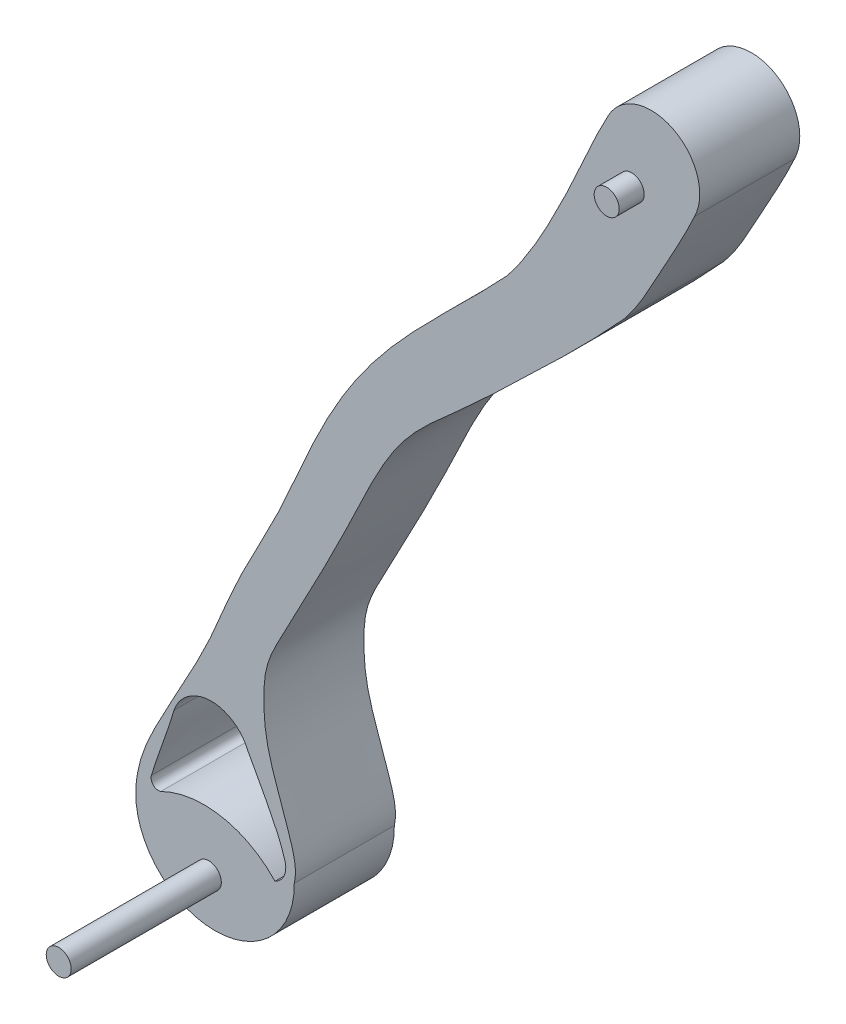
ISO-10303-21;
HEADER;
FILE_DESCRIPTION(('STEP AP214'),'2;1');
FILE_NAME('part.step','',(''),(''),'','','');
FILE_SCHEMA(('AUTOMOTIVE_DESIGN { 1 0 10303 214 1 1 1 1 }'));
ENDSEC;
DATA;
#1=APPLICATION_CONTEXT('core data for automotive mechanical design processes');
#2=APPLICATION_PROTOCOL_DEFINITION('international standard','automotive_design',2000,#1);
#3=PRODUCT_CONTEXT('',#1,'mechanical');
#4=PRODUCT('Part','Part','',(#3));
#5=PRODUCT_RELATED_PRODUCT_CATEGORY('part','',(#4));
#6=PRODUCT_DEFINITION_FORMATION('','',#4);
#7=PRODUCT_DEFINITION_CONTEXT('part definition',#1,'design');
#8=PRODUCT_DEFINITION('design','',#6,#7);
#9=PRODUCT_DEFINITION_SHAPE('','',#8);
#10=(LENGTH_UNIT() NAMED_UNIT(*) SI_UNIT(.MILLI.,.METRE.));
#11=(NAMED_UNIT(*) PLANE_ANGLE_UNIT() SI_UNIT($,.RADIAN.));
#12=(NAMED_UNIT(*) SI_UNIT($,.STERADIAN.) SOLID_ANGLE_UNIT());
#13=UNCERTAINTY_MEASURE_WITH_UNIT(LENGTH_MEASURE(1.E-05),#10,'distance_accuracy_value','');
#14=(GEOMETRIC_REPRESENTATION_CONTEXT(3) GLOBAL_UNCERTAINTY_ASSIGNED_CONTEXT((#13)) GLOBAL_UNIT_ASSIGNED_CONTEXT((#10,
#11,#12)) REPRESENTATION_CONTEXT('',''));
#15=CARTESIAN_POINT('',(0.,0.,0.));
#16=DIRECTION('',(0.,0.,1.));
#17=DIRECTION('',(1.,0.,0.));
#18=AXIS2_PLACEMENT_3D('',#15,#16,#17);
#19=CARTESIAN_POINT('',(60.3871939047688,187.542653548345,40.));
#20=CARTESIAN_POINT('',(55.8290363319542,179.301734235559,40.));
#21=CARTESIAN_POINT('',(48.5414420568133,162.180154607275,40.));
#22=CARTESIAN_POINT('',(36.0717803356837,136.393112865511,40.));
#23=CARTESIAN_POINT('',(26.2480929802239,119.800552758437,40.));
#24=CARTESIAN_POINT('',(19.9390279093565,111.952234191218,40.));
#25=B_SPLINE_CURVE_WITH_KNOTS('',3,(#19,#20,#21,#22,#23,#24),.UNSPECIFIED.,.F.,.F.,(4,1,1,4),
(0.,0.328457342126974,0.649354288135533,1.),.UNSPECIFIED.);
#26=DIRECTION('',(0.,0.,-1.));
#27=VECTOR('',#26,1.);
#28=SURFACE_OF_LINEAR_EXTRUSION('',#25,#27);
#29=CARTESIAN_POINT('',(60.3871939047688,187.542653548345,0.));
#30=CARTESIAN_POINT('',(55.8290363319542,179.301734235559,0.));
#31=CARTESIAN_POINT('',(48.5414420568133,162.180154607275,0.));
#32=CARTESIAN_POINT('',(36.0717803356837,136.393112865511,0.));
#33=CARTESIAN_POINT('',(26.2480929802239,119.800552758437,0.));
#34=CARTESIAN_POINT('',(19.9390279093565,111.952234191218,0.));
#35=B_SPLINE_CURVE_WITH_KNOTS('',3,(#29,#30,#31,#32,#33,#34),.UNSPECIFIED.,.F.,.F.,(4,1,1,4),
(0.,0.328457342126974,0.649354288135533,1.),.UNSPECIFIED.);
#36=CARTESIAN_POINT('',(60.3871939047688,187.542653548345,0.));
#37=VERTEX_POINT('',#36);
#38=CARTESIAN_POINT('',(19.9390279093565,111.952234191218,0.));
#39=VERTEX_POINT('',#38);
#40=EDGE_CURVE('E212',#37,#39,#35,.T.);
#41=ORIENTED_EDGE('',*,*,#40,.T.);
#42=DIRECTION('',(0.,0.,-1.));
#43=VECTOR('',#42,1.);
#44=CARTESIAN_POINT('',(19.9390279093565,111.952234191218,40.));
#45=LINE('',#44,#43);
#46=CARTESIAN_POINT('',(19.9390279093565,111.952234191218,40.));
#47=VERTEX_POINT('',#46);
#48=EDGE_CURVE('E261',#47,#39,#45,.T.);
#49=ORIENTED_EDGE('',*,*,#48,.F.);
#50=CARTESIAN_POINT('',(60.3871939047688,187.542653548345,40.));
#51=VERTEX_POINT('',#50);
#52=EDGE_CURVE('E246',#51,#47,#25,.T.);
#53=ORIENTED_EDGE('',*,*,#52,.F.);
#54=DIRECTION('',(0.,0.,-1.));
#55=VECTOR('',#54,1.);
#56=CARTESIAN_POINT('',(60.3871939047688,187.542653548345,40.));
#57=LINE('',#56,#55);
#58=EDGE_CURVE('E211',#51,#37,#57,.T.);
#59=ORIENTED_EDGE('',*,*,#58,.T.);
#60=EDGE_LOOP('',(#41,#49,#53,#59));
#61=FACE_BOUND('',#60,.T.);
#62=ADVANCED_FACE('F40',(#61),#28,.F.);
#63=CARTESIAN_POINT('',(19.9390279093565,111.952234191218,40.));
#64=CARTESIAN_POINT('',(3.65232556956879,94.3290387479032,40.));
#65=CARTESIAN_POINT('',(-20.2496056722117,73.6219313673964,40.));
#66=CARTESIAN_POINT('',(-45.6524290616376,39.0411420736974,40.));
#67=CARTESIAN_POINT('',(-58.8426468973011,13.6097033064801,40.));
#68=CARTESIAN_POINT('',(-71.7894873232042,-18.0719905640691,40.));
#69=CARTESIAN_POINT('',(-87.738861669202,-45.500334261071,40.));
#70=CARTESIAN_POINT('',(-100.863433522927,-79.9213549862569,40.));
#71=CARTESIAN_POINT('',(-115.452059141126,-103.788445803052,40.));
#72=CARTESIAN_POINT('',(-126.143907941595,-125.769991296804,40.));
#73=CARTESIAN_POINT('',(-128.340182149036,-135.353702394417,40.));
#74=CARTESIAN_POINT('',(-128.435303346591,-140.896902452704,40.));
#75=B_SPLINE_CURVE_WITH_KNOTS('',3,(#63,#64,#65,#66,#67,#68,#69,#70,#71,#72,#73,#74),
.UNSPECIFIED.,.F.,.F.,(4,1,1,1,1,1,1,1,1,4),(0.,0.227860935563209,0.297082932040431,
0.405625713010245,0.49841550509689,0.621398377971298,0.705377541129316,0.846798383266303,
0.885360920028116,0.937345031613258),.UNSPECIFIED.);
#76=DIRECTION('',(0.,0.,-1.));
#77=VECTOR('',#76,1.);
#78=SURFACE_OF_LINEAR_EXTRUSION('',#75,#77);
#79=CARTESIAN_POINT('',(19.9390279093565,111.952234191218,0.));
#80=CARTESIAN_POINT('',(3.65232556956879,94.3290387479032,0.));
#81=CARTESIAN_POINT('',(-20.2496056722117,73.6219313673964,0.));
#82=CARTESIAN_POINT('',(-45.6524290616376,39.0411420736974,0.));
#83=CARTESIAN_POINT('',(-58.8426468973011,13.6097033064801,0.));
#84=CARTESIAN_POINT('',(-71.7894873232042,-18.0719905640691,0.));
#85=CARTESIAN_POINT('',(-87.738861669202,-45.500334261071,0.));
#86=CARTESIAN_POINT('',(-100.863433522927,-79.9213549862569,0.));
#87=CARTESIAN_POINT('',(-115.452059141126,-103.788445803052,0.));
#88=CARTESIAN_POINT('',(-126.143907941595,-125.769991296804,0.));
#89=CARTESIAN_POINT('',(-128.340182149036,-135.353702394417,0.));
#90=CARTESIAN_POINT('',(-128.435303346591,-140.896902452704,0.));
#91=B_SPLINE_CURVE_WITH_KNOTS('',3,(#79,#80,#81,#82,#83,#84,#85,#86,#87,#88,#89,#90),
.UNSPECIFIED.,.F.,.F.,(4,1,1,1,1,1,1,1,1,4),(0.,0.227860935563209,0.297082932040431,
0.405625713010245,0.49841550509689,0.621398377971298,0.705377541129316,0.846798383266303,
0.885360920028116,0.937345031613258),.UNSPECIFIED.);
#92=CARTESIAN_POINT('',(-128.435303346591,-140.896902452704,0.));
#93=VERTEX_POINT('',#92);
#94=EDGE_CURVE('E217',#39,#93,#91,.T.);
#95=ORIENTED_EDGE('',*,*,#94,.T.);
#96=DIRECTION('',(0.,0.,-1.));
#97=VECTOR('',#96,1.);
#98=CARTESIAN_POINT('',(-128.435303346591,-140.896902452704,40.));
#99=LINE('',#98,#97);
#100=CARTESIAN_POINT('',(-128.435303346591,-140.896902452704,40.));
#101=VERTEX_POINT('',#100);
#102=EDGE_CURVE('E258',#101,#93,#99,.T.);
#103=ORIENTED_EDGE('',*,*,#102,.F.);
#104=EDGE_CURVE('E298',#47,#101,#75,.T.);
#105=ORIENTED_EDGE('',*,*,#104,.F.);
#106=ORIENTED_EDGE('',*,*,#48,.T.);
#107=EDGE_LOOP('',(#95,#103,#105,#106));
#108=FACE_BOUND('',#107,.T.);
#109=ADVANCED_FACE('F297',(#108),#78,.F.);
#110=CARTESIAN_POINT('',(-96.7551495256795,-141.440533232487,40.));
#111=DIRECTION('',(0.,0.,-1.));
#112=DIRECTION('',(-1.,0.,0.));
#113=AXIS2_PLACEMENT_3D('',#110,#111,#112);
#114=CYLINDRICAL_SURFACE('',#113,31.6848178240202);
#115=CARTESIAN_POINT('',(-96.7551495256795,-141.440533232487,0.));
#116=DIRECTION('',(0.,0.,1.));
#117=DIRECTION('',(1.,0.,0.));
#118=AXIS2_PLACEMENT_3D('',#115,#116,#117);
#119=CIRCLE('',#118,31.6848178240202);
#120=CARTESIAN_POINT('',(-65.0749957047679,-140.896902452704,0.));
#121=VERTEX_POINT('',#120);
#122=EDGE_CURVE('E225',#93,#121,#119,.T.);
#123=ORIENTED_EDGE('',*,*,#122,.T.);
#124=DIRECTION('',(0.,0.,-1.));
#125=VECTOR('',#124,1.);
#126=CARTESIAN_POINT('',(-65.0749957047679,-140.896902452704,40.));
#127=LINE('',#126,#125);
#128=CARTESIAN_POINT('',(-65.0749957047679,-140.896902452704,40.));
#129=VERTEX_POINT('',#128);
#130=EDGE_CURVE('E255',#129,#121,#127,.T.);
#131=ORIENTED_EDGE('',*,*,#130,.F.);
#132=CARTESIAN_POINT('',(-96.7551495256795,-141.440533232487,40.));
#133=DIRECTION('',(0.,0.,1.));
#134=DIRECTION('',(1.,0.,0.));
#135=AXIS2_PLACEMENT_3D('',#132,#133,#134);
#136=CIRCLE('',#135,31.6848178240202);
#137=EDGE_CURVE('E294',#101,#129,#136,.T.);
#138=ORIENTED_EDGE('',*,*,#137,.F.);
#139=ORIENTED_EDGE('',*,*,#102,.T.);
#140=EDGE_LOOP('',(#123,#131,#138,#139));
#141=FACE_BOUND('',#140,.T.);
#142=ADVANCED_FACE('F293',(#141),#114,.T.);
#143=CARTESIAN_POINT('',(-65.0749957047679,-140.896902452704,40.));
#144=CARTESIAN_POINT('',(-63.9076520974631,-135.874645519981,40.));
#145=CARTESIAN_POINT('',(-66.351009120268,-126.659238678966,40.));
#146=CARTESIAN_POINT('',(-71.697657004547,-112.128089654056,40.));
#147=CARTESIAN_POINT('',(-76.3347123156339,-98.4722093976341,40.));
#148=CARTESIAN_POINT('',(-77.5417094464005,-84.2071987317642,40.));
#149=CARTESIAN_POINT('',(-76.9619608186878,-70.3420925391163,40.));
#150=CARTESIAN_POINT('',(-68.8857927603554,-55.6949594400587,40.));
#151=CARTESIAN_POINT('',(-58.2138452567508,-35.3055248491132,40.));
#152=CARTESIAN_POINT('',(-45.109839413962,-10.2853251386272,40.));
#153=CARTESIAN_POINT('',(-33.8512418556575,14.9392911187335,40.));
#154=CARTESIAN_POINT('',(-19.441261207989,38.761764832245,40.));
#155=CARTESIAN_POINT('',(0.346111339632618,54.84625305736,40.));
#156=CARTESIAN_POINT('',(30.1496907967711,83.3530804332558,40.));
#157=CARTESIAN_POINT('',(52.0052503732417,104.15599097624,40.));
#158=CARTESIAN_POINT('',(66.8758658751505,120.550338304471,40.));
#159=B_SPLINE_CURVE_WITH_KNOTS('',3,(#143,#144,#145,#146,#147,#148,#149,#150,#151,#152,#153,
#154,#155,#156,#157,#158),.UNSPECIFIED.,.F.,.F.,(4,1,1,1,1,1,1,1,1,1,1,1,1,4),(0.,
0.046869520106327,0.0901417125794342,0.14858122636721,0.183456914359763,0.226900489242656,
0.278590853817405,0.340349479488274,0.448130788079936,0.547901996865662,0.604794059024926,
0.712230619265801,0.788345355237952,1.),.UNSPECIFIED.);
#160=DIRECTION('',(0.,0.,-1.));
#161=VECTOR('',#160,1.);
#162=SURFACE_OF_LINEAR_EXTRUSION('',#159,#161);
#163=CARTESIAN_POINT('',(-65.0749957047679,-140.896902452704,0.));
#164=CARTESIAN_POINT('',(-63.9076520974631,-135.874645519981,0.));
#165=CARTESIAN_POINT('',(-66.351009120268,-126.659238678966,0.));
#166=CARTESIAN_POINT('',(-71.697657004547,-112.128089654056,0.));
#167=CARTESIAN_POINT('',(-76.3347123156339,-98.4722093976341,0.));
#168=CARTESIAN_POINT('',(-77.5417094464005,-84.2071987317642,0.));
#169=CARTESIAN_POINT('',(-76.9619608186878,-70.3420925391163,0.));
#170=CARTESIAN_POINT('',(-68.8857927603554,-55.6949594400587,0.));
#171=CARTESIAN_POINT('',(-58.2138452567508,-35.3055248491132,0.));
#172=CARTESIAN_POINT('',(-45.109839413962,-10.2853251386272,0.));
#173=CARTESIAN_POINT('',(-33.8512418556575,14.9392911187335,0.));
#174=CARTESIAN_POINT('',(-19.441261207989,38.761764832245,0.));
#175=CARTESIAN_POINT('',(0.346111339632618,54.84625305736,0.));
#176=CARTESIAN_POINT('',(30.1496907967711,83.3530804332558,0.));
#177=CARTESIAN_POINT('',(52.0052503732417,104.15599097624,0.));
#178=CARTESIAN_POINT('',(66.8758658751505,120.550338304471,0.));
#179=B_SPLINE_CURVE_WITH_KNOTS('',3,(#163,#164,#165,#166,#167,#168,#169,#170,#171,#172,#173,
#174,#175,#176,#177,#178),.UNSPECIFIED.,.F.,.F.,(4,1,1,1,1,1,1,1,1,1,1,1,1,4),(0.,
0.046869520106327,0.0901417125794342,0.14858122636721,0.183456914359763,0.226900489242656,
0.278590853817405,0.340349479488274,0.448130788079936,0.547901996865662,0.604794059024926,
0.712230619265801,0.788345355237952,1.),.UNSPECIFIED.);
#180=CARTESIAN_POINT('',(66.8758658751505,120.550338304471,0.));
#181=VERTEX_POINT('',#180);
#182=EDGE_CURVE('E230',#121,#181,#179,.T.);
#183=ORIENTED_EDGE('',*,*,#182,.T.);
#184=DIRECTION('',(0.,0.,-1.));
#185=VECTOR('',#184,1.);
#186=CARTESIAN_POINT('',(66.8758658751505,120.550338304471,40.));
#187=LINE('',#186,#185);
#188=CARTESIAN_POINT('',(66.8758658751505,120.550338304471,40.));
#189=VERTEX_POINT('',#188);
#190=EDGE_CURVE('E252',#189,#181,#187,.T.);
#191=ORIENTED_EDGE('',*,*,#190,.F.);
#192=EDGE_CURVE('E202',#129,#189,#159,.T.);
#193=ORIENTED_EDGE('',*,*,#192,.F.);
#194=ORIENTED_EDGE('',*,*,#130,.T.);
#195=EDGE_LOOP('',(#183,#191,#193,#194));
#196=FACE_BOUND('',#195,.T.);
#197=ADVANCED_FACE('F192',(#196),#162,.F.);
#198=CARTESIAN_POINT('',(66.8758658751505,120.550338304471,40.));
#199=CARTESIAN_POINT('',(72.3865565632837,127.199137849792,40.));
#200=CARTESIAN_POINT('',(81.1017354369889,144.070801532341,40.));
#201=CARTESIAN_POINT('',(90.5875806479653,160.476032838296,40.));
#202=CARTESIAN_POINT('',(94.8964834466866,169.931016126953,40.));
#203=B_SPLINE_CURVE_WITH_KNOTS('',3,(#198,#199,#200,#201,#202),.UNSPECIFIED.,.F.,.F.,(4,1,4),
(0.,0.452321954450855,1.),.UNSPECIFIED.);
#204=DIRECTION('',(0.,0.,-1.));
#205=VECTOR('',#204,1.);
#206=SURFACE_OF_LINEAR_EXTRUSION('',#203,#205);
#207=CARTESIAN_POINT('',(66.8758658751505,120.550338304471,0.));
#208=CARTESIAN_POINT('',(72.3865565632837,127.199137849792,0.));
#209=CARTESIAN_POINT('',(81.1017354369889,144.070801532341,0.));
#210=CARTESIAN_POINT('',(90.5875806479653,160.476032838296,0.));
#211=CARTESIAN_POINT('',(94.8964834466866,169.931016126953,0.));
#212=B_SPLINE_CURVE_WITH_KNOTS('',3,(#207,#208,#209,#210,#211),.UNSPECIFIED.,.F.,.F.,(4,1,4),
(0.,0.452321954450855,1.),.UNSPECIFIED.);
#213=CARTESIAN_POINT('',(94.8964834466866,169.931016126953,0.));
#214=VERTEX_POINT('',#213);
#215=EDGE_CURVE('E234',#181,#214,#212,.T.);
#216=ORIENTED_EDGE('',*,*,#215,.T.);
#217=DIRECTION('',(0.,0.,-1.));
#218=VECTOR('',#217,1.);
#219=CARTESIAN_POINT('',(94.8964834466866,169.931016126953,40.));
#220=LINE('',#219,#218);
#221=CARTESIAN_POINT('',(94.8964834466866,169.931016126953,40.));
#222=VERTEX_POINT('',#221);
#223=EDGE_CURVE('E249',#222,#214,#220,.T.);
#224=ORIENTED_EDGE('',*,*,#223,.F.);
#225=EDGE_CURVE('E196',#189,#222,#203,.T.);
#226=ORIENTED_EDGE('',*,*,#225,.F.);
#227=ORIENTED_EDGE('',*,*,#190,.T.);
#228=EDGE_LOOP('',(#216,#224,#226,#227));
#229=FACE_BOUND('',#228,.T.);
#230=ADVANCED_FACE('F187',(#229),#206,.F.);
#231=CARTESIAN_POINT('',(77.6418386757277,178.736834837649,40.));
#232=DIRECTION('',(0.,0.,-1.));
#233=DIRECTION('',(-1.,0.,0.));
#234=AXIS2_PLACEMENT_3D('',#231,#232,#233);
#235=CYLINDRICAL_SURFACE('',#234,19.3717631964059);
#236=CARTESIAN_POINT('',(77.6418386757277,178.736834837649,0.));
#237=DIRECTION('',(0.,0.,1.));
#238=DIRECTION('',(1.,0.,0.));
#239=AXIS2_PLACEMENT_3D('',#236,#237,#238);
#240=CIRCLE('',#239,19.3717631964059);
#241=EDGE_CURVE('E241',#214,#37,#240,.T.);
#242=ORIENTED_EDGE('',*,*,#241,.T.);
#243=ORIENTED_EDGE('',*,*,#58,.F.);
#244=CARTESIAN_POINT('',(77.6418386757277,178.736834837649,40.));
#245=DIRECTION('',(0.,0.,1.));
#246=DIRECTION('',(1.,0.,0.));
#247=AXIS2_PLACEMENT_3D('',#244,#245,#246);
#248=CIRCLE('',#247,19.3717631964059);
#249=EDGE_CURVE('E201',#222,#51,#248,.T.);
#250=ORIENTED_EDGE('',*,*,#249,.F.);
#251=ORIENTED_EDGE('',*,*,#223,.T.);
#252=EDGE_LOOP('',(#242,#243,#250,#251));
#253=FACE_BOUND('',#252,.T.);
#254=ADVANCED_FACE('F180',(#253),#235,.T.);
#255=CARTESIAN_POINT('',(41.9594234862686,148.749008778062,40.));
#256=DIRECTION('',(0.,0.,-1.));
#257=DIRECTION('',(-1.,0.,0.));
#258=AXIS2_PLACEMENT_3D('',#255,#256,#257);
#259=PLANE('',#258);
#260=CARTESIAN_POINT('',(-99.2300932035587,-155.129512748989,40.));
#261=DIRECTION('',(0.,0.,-1.));
#262=DIRECTION('',(-1.,0.,0.));
#263=AXIS2_PLACEMENT_3D('',#260,#261,#262);
#264=CIRCLE('',#263,5.00000000000001);
#265=CARTESIAN_POINT('',(-104.230093203559,-155.129512748989,40.));
#266=VERTEX_POINT('',#265);
#267=EDGE_CURVE('E11',#266,#266,#264,.F.);
#268=ORIENTED_EDGE('',*,*,#267,.F.);
#269=EDGE_LOOP('',(#268));
#270=FACE_BOUND('',#269,.T.);
#271=CARTESIAN_POINT('',(-98.2680109010432,-110.139148104307,40.));
#272=DIRECTION('',(0.,0.,-1.));
#273=DIRECTION('',(-1.,0.,0.));
#274=AXIS2_PLACEMENT_3D('',#271,#272,#273);
#275=CIRCLE('',#274,15.7577300745778);
#276=CARTESIAN_POINT('',(-113.174364561703,-105.029678694809,40.));
#277=VERTEX_POINT('',#276);
#278=CARTESIAN_POINT('',(-83.767621929173,-103.971103295154,40.));
#279=VERTEX_POINT('',#278);
#280=EDGE_CURVE('E137',#277,#279,#275,.T.);
#281=ORIENTED_EDGE('',*,*,#280,.T.);
#282=CARTESIAN_POINT('',(-83.767621929173,-103.971103295154,40.));
#283=CARTESIAN_POINT('',(-83.5873518221978,-104.298739765715,40.));
#284=CARTESIAN_POINT('',(-81.9140125138247,-107.339065994013,40.));
#285=CARTESIAN_POINT('',(-79.5056807611094,-111.713780783624,40.));
#286=CARTESIAN_POINT('',(-76.6247828079274,-117.103856722549,40.));
#287=CARTESIAN_POINT('',(-74.5149876082828,-121.165521306411,40.));
#288=CARTESIAN_POINT('',(-72.5233715707377,-125.181904734384,40.));
#289=CARTESIAN_POINT('',(-70.7511149933077,-129.174468609595,40.));
#290=CARTESIAN_POINT('',(-69.5361784966292,-132.477867127564,40.));
#291=CARTESIAN_POINT('',(-68.9335514776586,-134.470064330966,40.));
#292=CARTESIAN_POINT('',(-68.756079477371,-135.101198343125,40.));
#293=B_SPLINE_CURVE_WITH_KNOTS('',3,(#282,#283,#284,#285,#286,#287,#288,#289,#290,#291,#292),
.UNSPECIFIED.,.F.,.F.,(4,1,1,1,1,1,1,1,4),(0.78726205462932,0.790799640659053,0.820108718849894,
0.834763257945314,0.849417797040735,0.864072336136155,0.878726875231576,0.893381414326996,
0.900142659372409),.UNSPECIFIED.);
#294=CARTESIAN_POINT('',(-68.756079477371,-135.101198343125,40.));
#295=VERTEX_POINT('',#294);
#296=EDGE_CURVE('E131',#279,#295,#293,.T.);
#297=ORIENTED_EDGE('',*,*,#296,.T.);
#298=CARTESIAN_POINT('',(-76.0350356200496,-137.174185438122,40.));
#299=DIRECTION('',(0.,0.,-1.));
#300=DIRECTION('',(-1.,0.,0.));
#301=AXIS2_PLACEMENT_3D('',#298,#299,#300);
#302=CIRCLE('',#301,7.56838675168399);
#303=CARTESIAN_POINT('',(-72.7671763250433,-144.000719965326,40.));
#304=VERTEX_POINT('',#303);
#305=EDGE_CURVE('E140',#295,#304,#302,.T.);
#306=ORIENTED_EDGE('',*,*,#305,.T.);
#307=CARTESIAN_POINT('',(-101.151055014439,-170.490756136762,40.));
#308=DIRECTION('',(0.,0.,1.));
#309=DIRECTION('',(-1.,0.,0.));
#310=AXIS2_PLACEMENT_3D('',#307,#308,#309);
#311=CIRCLE('',#310,38.8248191987845);
#312=CARTESIAN_POINT('',(-118.409854589952,-135.71288353031,40.));
#313=VERTEX_POINT('',#312);
#314=EDGE_CURVE('E55',#304,#313,#311,.T.);
#315=ORIENTED_EDGE('',*,*,#314,.T.);
#316=CARTESIAN_POINT('',(-119.395416627931,-132.968075227075,40.));
#317=DIRECTION('',(0.,0.,-1.));
#318=DIRECTION('',(-1.,0.,0.));
#319=AXIS2_PLACEMENT_3D('',#316,#317,#318);
#320=CIRCLE('',#319,2.91638563160215);
#321=CARTESIAN_POINT('',(-122.117435387313,-131.921213714845,40.));
#322=VERTEX_POINT('',#321);
#323=EDGE_CURVE('E470',#313,#322,#320,.T.);
#324=ORIENTED_EDGE('',*,*,#323,.T.);
#325=CARTESIAN_POINT('',(-122.117435387313,-131.921213714845,40.));
#326=CARTESIAN_POINT('',(-121.902241698116,-131.121274345062,40.));
#327=CARTESIAN_POINT('',(-121.440830196153,-129.57026566349,40.));
#328=CARTESIAN_POINT('',(-120.671868024191,-127.192672605094,40.));
#329=CARTESIAN_POINT('',(-119.652569306588,-124.170271778331,40.));
#330=CARTESIAN_POINT('',(-118.30466128808,-120.363805325728,40.));
#331=CARTESIAN_POINT('',(-116.083389287069,-114.194015199901,40.));
#332=CARTESIAN_POINT('',(-114.313518516747,-109.046051234717,40.));
#333=CARTESIAN_POINT('',(-113.271974892819,-105.380725172154,40.));
#334=CARTESIAN_POINT('',(-113.174364561703,-105.029678694809,40.));
#335=B_SPLINE_CURVE_WITH_KNOTS('',3,(#325,#326,#327,#328,#329,#330,#331,#332,#333,#334),
.UNSPECIFIED.,.F.,.F.,(4,1,1,1,1,1,1,4),(0.0361999933541439,0.0449983752809423,
0.0528232545126927,0.0606481337444431,0.0762978922079439,0.0919476506714447,0.123247167598446,
0.126550228804812),.UNSPECIFIED.);
#336=EDGE_CURVE('E464',#322,#277,#335,.T.);
#337=ORIENTED_EDGE('',*,*,#336,.T.);
#338=EDGE_LOOP('',(#281,#297,#306,#315,#324,#337));
#339=FACE_BOUND('',#338,.T.);
#340=CARTESIAN_POINT('',(69.8193877085274,167.582956348483,40.));
#341=DIRECTION('',(0.,0.,-1.));
#342=DIRECTION('',(-1.,0.,0.));
#343=AXIS2_PLACEMENT_3D('',#340,#341,#342);
#344=CIRCLE('',#343,5.00000000000001);
#345=CARTESIAN_POINT('',(64.8193877085274,167.582956348483,40.));
#346=VERTEX_POINT('',#345);
#347=EDGE_CURVE('E264',#346,#346,#344,.F.);
#348=ORIENTED_EDGE('',*,*,#347,.F.);
#349=EDGE_LOOP('',(#348));
#350=FACE_BOUND('',#349,.T.);
#351=ORIENTED_EDGE('',*,*,#52,.T.);
#352=ORIENTED_EDGE('',*,*,#104,.T.);
#353=ORIENTED_EDGE('',*,*,#137,.T.);
#354=ORIENTED_EDGE('',*,*,#192,.T.);
#355=ORIENTED_EDGE('',*,*,#225,.T.);
#356=ORIENTED_EDGE('',*,*,#249,.T.);
#357=EDGE_LOOP('',(#351,#352,#353,#354,#355,#356));
#358=FACE_BOUND('',#357,.T.);
#359=ADVANCED_FACE('F144',(#270,#339,#350,#358),#259,.F.);
#360=CARTESIAN_POINT('',(41.9594234862686,148.749008778062,0.));
#361=DIRECTION('',(0.,0.,-1.));
#362=DIRECTION('',(-1.,0.,0.));
#363=AXIS2_PLACEMENT_3D('',#360,#361,#362);
#364=PLANE('',#363);
#365=CARTESIAN_POINT('',(69.8193877085274,167.582956348483,0.));
#366=DIRECTION('',(0.,0.,-1.));
#367=DIRECTION('',(-1.,0.,0.));
#368=AXIS2_PLACEMENT_3D('',#365,#366,#367);
#369=CIRCLE('',#368,5.00000000000001);
#370=CARTESIAN_POINT('',(64.8193877085274,167.582956348483,0.));
#371=VERTEX_POINT('',#370);
#372=EDGE_CURVE('E48',#371,#371,#369,.T.);
#373=ORIENTED_EDGE('',*,*,#372,.F.);
#374=EDGE_LOOP('',(#373));
#375=FACE_BOUND('',#374,.T.);
#376=CARTESIAN_POINT('',(-83.767621929173,-103.971103295154,0.));
#377=CARTESIAN_POINT('',(-83.5873518221978,-104.298739765715,0.));
#378=CARTESIAN_POINT('',(-81.9140125138247,-107.339065994013,0.));
#379=CARTESIAN_POINT('',(-79.5056807611094,-111.713780783624,0.));
#380=CARTESIAN_POINT('',(-76.6247828079274,-117.103856722549,0.));
#381=CARTESIAN_POINT('',(-74.5149876082828,-121.165521306411,0.));
#382=CARTESIAN_POINT('',(-72.5233715707377,-125.181904734384,0.));
#383=CARTESIAN_POINT('',(-70.7511149933077,-129.174468609595,0.));
#384=CARTESIAN_POINT('',(-69.5361784966292,-132.477867127564,0.));
#385=CARTESIAN_POINT('',(-68.9335514776586,-134.470064330966,0.));
#386=CARTESIAN_POINT('',(-68.756079477371,-135.101198343125,0.));
#387=B_SPLINE_CURVE_WITH_KNOTS('',3,(#376,#377,#378,#379,#380,#381,#382,#383,#384,#385,#386),
.UNSPECIFIED.,.F.,.F.,(4,1,1,1,1,1,1,1,4),(0.78726205462932,0.790799640659053,0.820108718849894,
0.834763257945314,0.849417797040735,0.864072336136155,0.878726875231576,0.893381414326996,
0.900142659372409),.UNSPECIFIED.);
#388=CARTESIAN_POINT('',(-83.767621929173,-103.971103295154,0.));
#389=VERTEX_POINT('',#388);
#390=CARTESIAN_POINT('',(-68.756079477371,-135.101198343125,0.));
#391=VERTEX_POINT('',#390);
#392=EDGE_CURVE('E63',#389,#391,#387,.T.);
#393=ORIENTED_EDGE('',*,*,#392,.F.);
#394=CARTESIAN_POINT('',(-98.2680109010432,-110.139148104307,0.));
#395=DIRECTION('',(0.,0.,-1.));
#396=DIRECTION('',(-1.,0.,0.));
#397=AXIS2_PLACEMENT_3D('',#394,#395,#396);
#398=CIRCLE('',#397,15.7577300745778);
#399=CARTESIAN_POINT('',(-113.174364561703,-105.029678694809,0.));
#400=VERTEX_POINT('',#399);
#401=EDGE_CURVE('E148',#400,#389,#398,.T.);
#402=ORIENTED_EDGE('',*,*,#401,.F.);
#403=CARTESIAN_POINT('',(-122.117435387313,-131.921213714845,0.));
#404=CARTESIAN_POINT('',(-121.902241698116,-131.121274345062,0.));
#405=CARTESIAN_POINT('',(-121.440830196153,-129.57026566349,0.));
#406=CARTESIAN_POINT('',(-120.671868024191,-127.192672605094,0.));
#407=CARTESIAN_POINT('',(-119.652569306588,-124.170271778331,0.));
#408=CARTESIAN_POINT('',(-118.30466128808,-120.363805325728,0.));
#409=CARTESIAN_POINT('',(-116.083389287069,-114.194015199901,0.));
#410=CARTESIAN_POINT('',(-114.313518516747,-109.046051234717,0.));
#411=CARTESIAN_POINT('',(-113.271974892819,-105.380725172154,0.));
#412=CARTESIAN_POINT('',(-113.174364561703,-105.029678694809,0.));
#413=B_SPLINE_CURVE_WITH_KNOTS('',3,(#403,#404,#405,#406,#407,#408,#409,#410,#411,#412),
.UNSPECIFIED.,.F.,.F.,(4,1,1,1,1,1,1,4),(0.0361999933541439,0.0449983752809423,
0.0528232545126927,0.0606481337444431,0.0762978922079439,0.0919476506714447,0.123247167598446,
0.126550228804812),.UNSPECIFIED.);
#414=CARTESIAN_POINT('',(-122.117435387313,-131.921213714845,0.));
#415=VERTEX_POINT('',#414);
#416=EDGE_CURVE('E151',#415,#400,#413,.T.);
#417=ORIENTED_EDGE('',*,*,#416,.F.);
#418=CARTESIAN_POINT('',(-119.395416627931,-132.968075227075,0.));
#419=DIRECTION('',(0.,0.,-1.));
#420=DIRECTION('',(-1.,0.,0.));
#421=AXIS2_PLACEMENT_3D('',#418,#419,#420);
#422=CIRCLE('',#421,2.91638563160215);
#423=CARTESIAN_POINT('',(-118.409854589952,-135.71288353031,0.));
#424=VERTEX_POINT('',#423);
#425=EDGE_CURVE('E486',#424,#415,#422,.T.);
#426=ORIENTED_EDGE('',*,*,#425,.F.);
#427=CARTESIAN_POINT('',(-101.151055014439,-170.490756136762,0.));
#428=DIRECTION('',(0.,0.,1.));
#429=DIRECTION('',(-1.,0.,0.));
#430=AXIS2_PLACEMENT_3D('',#427,#428,#429);
#431=CIRCLE('',#430,38.8248191987845);
#432=CARTESIAN_POINT('',(-72.7671763250433,-144.000719965326,0.));
#433=VERTEX_POINT('',#432);
#434=EDGE_CURVE('E483',#433,#424,#431,.T.);
#435=ORIENTED_EDGE('',*,*,#434,.F.);
#436=CARTESIAN_POINT('',(-76.0350356200496,-137.174185438122,0.));
#437=DIRECTION('',(0.,0.,-1.));
#438=DIRECTION('',(-1.,0.,0.));
#439=AXIS2_PLACEMENT_3D('',#436,#437,#438);
#440=CIRCLE('',#439,7.56838675168399);
#441=EDGE_CURVE('E478',#391,#433,#440,.T.);
#442=ORIENTED_EDGE('',*,*,#441,.F.);
#443=EDGE_LOOP('',(#393,#402,#417,#426,#435,#442));
#444=FACE_BOUND('',#443,.T.);
#445=ORIENTED_EDGE('',*,*,#40,.F.);
#446=ORIENTED_EDGE('',*,*,#241,.F.);
#447=ORIENTED_EDGE('',*,*,#215,.F.);
#448=ORIENTED_EDGE('',*,*,#182,.F.);
#449=ORIENTED_EDGE('',*,*,#122,.F.);
#450=ORIENTED_EDGE('',*,*,#94,.F.);
#451=EDGE_LOOP('',(#445,#446,#447,#448,#449,#450));
#452=FACE_BOUND('',#451,.T.);
#453=ADVANCED_FACE('F176',(#375,#444,#452),#364,.T.);
#454=CARTESIAN_POINT('',(69.8193877085274,167.582956348483,50.));
#455=DIRECTION('',(0.,0.,-1.));
#456=DIRECTION('',(-1.,0.,0.));
#457=AXIS2_PLACEMENT_3D('',#454,#455,#456);
#458=CYLINDRICAL_SURFACE('',#457,5.00000000000001);
#459=CARTESIAN_POINT('',(69.8193877085274,167.582956348483,50.));
#460=DIRECTION('',(0.,0.,1.));
#461=DIRECTION('',(1.,0.,0.));
#462=AXIS2_PLACEMENT_3D('',#459,#460,#461);
#463=CIRCLE('',#462,5.00000000000001);
#464=CARTESIAN_POINT('',(74.8193877085274,167.582956348483,50.));
#465=VERTEX_POINT('',#464);
#466=EDGE_CURVE('E218',#465,#465,#463,.T.);
#467=ORIENTED_EDGE('',*,*,#466,.F.);
#468=EDGE_LOOP('',(#467));
#469=FACE_BOUND('',#468,.T.);
#470=ORIENTED_EDGE('',*,*,#347,.T.);
#471=EDGE_LOOP('',(#470));
#472=FACE_BOUND('',#471,.T.);
#473=ADVANCED_FACE('F172',(#469,#472),#458,.T.);
#474=CARTESIAN_POINT('',(69.8193877085274,167.582956348483,50.));
#475=DIRECTION('',(0.,0.,1.));
#476=DIRECTION('',(1.,0.,0.));
#477=AXIS2_PLACEMENT_3D('',#474,#475,#476);
#478=PLANE('',#477);
#479=ORIENTED_EDGE('',*,*,#466,.T.);
#480=EDGE_LOOP('',(#479));
#481=FACE_BOUND('',#480,.T.);
#482=ADVANCED_FACE('F168',(#481),#478,.T.);
#483=DIRECTION('',(0.,0.,-1.));
#484=VECTOR('',#483,1.);
#485=SURFACE_OF_LINEAR_EXTRUSION('',#293,#484);
#486=ORIENTED_EDGE('',*,*,#392,.T.);
#487=DIRECTION('',(0.,0.,-1.));
#488=VECTOR('',#487,1.);
#489=CARTESIAN_POINT('',(-68.756079477371,-135.101198343125,40.));
#490=LINE('',#489,#488);
#491=EDGE_CURVE('E127',#295,#391,#490,.T.);
#492=ORIENTED_EDGE('',*,*,#491,.F.);
#493=ORIENTED_EDGE('',*,*,#296,.F.);
#494=DIRECTION('',(0.,0.,-1.));
#495=VECTOR('',#494,1.);
#496=CARTESIAN_POINT('',(-83.767621929173,-103.971103295154,40.));
#497=LINE('',#496,#495);
#498=EDGE_CURVE('E496',#279,#389,#497,.T.);
#499=ORIENTED_EDGE('',*,*,#498,.T.);
#500=EDGE_LOOP('',(#486,#492,#493,#499));
#501=FACE_BOUND('',#500,.T.);
#502=ADVANCED_FACE('F129',(#501),#485,.F.);
#503=CARTESIAN_POINT('',(-98.2680109010432,-110.139148104307,40.));
#504=DIRECTION('',(0.,0.,-1.));
#505=DIRECTION('',(-1.,0.,0.));
#506=AXIS2_PLACEMENT_3D('',#503,#504,#505);
#507=CYLINDRICAL_SURFACE('',#506,15.7577300745778);
#508=ORIENTED_EDGE('',*,*,#401,.T.);
#509=ORIENTED_EDGE('',*,*,#498,.F.);
#510=ORIENTED_EDGE('',*,*,#280,.F.);
#511=DIRECTION('',(0.,0.,-1.));
#512=VECTOR('',#511,1.);
#513=CARTESIAN_POINT('',(-113.174364561703,-105.029678694809,40.));
#514=LINE('',#513,#512);
#515=EDGE_CURVE('E498',#277,#400,#514,.T.);
#516=ORIENTED_EDGE('',*,*,#515,.T.);
#517=EDGE_LOOP('',(#508,#509,#510,#516));
#518=FACE_BOUND('',#517,.T.);
#519=ADVANCED_FACE('F167',(#518),#507,.F.);
#520=DIRECTION('',(0.,0.,-1.));
#521=VECTOR('',#520,1.);
#522=SURFACE_OF_LINEAR_EXTRUSION('',#335,#521);
#523=ORIENTED_EDGE('',*,*,#416,.T.);
#524=ORIENTED_EDGE('',*,*,#515,.F.);
#525=ORIENTED_EDGE('',*,*,#336,.F.);
#526=DIRECTION('',(0.,0.,-1.));
#527=VECTOR('',#526,1.);
#528=CARTESIAN_POINT('',(-122.117435387313,-131.921213714845,40.));
#529=LINE('',#528,#527);
#530=EDGE_CURVE('E500',#322,#415,#529,.T.);
#531=ORIENTED_EDGE('',*,*,#530,.T.);
#532=EDGE_LOOP('',(#523,#524,#525,#531));
#533=FACE_BOUND('',#532,.T.);
#534=ADVANCED_FACE('F378',(#533),#522,.F.);
#535=CARTESIAN_POINT('',(-119.395416627931,-132.968075227075,40.));
#536=DIRECTION('',(0.,0.,-1.));
#537=DIRECTION('',(-1.,0.,0.));
#538=AXIS2_PLACEMENT_3D('',#535,#536,#537);
#539=CYLINDRICAL_SURFACE('',#538,2.91638563160215);
#540=ORIENTED_EDGE('',*,*,#425,.T.);
#541=ORIENTED_EDGE('',*,*,#530,.F.);
#542=ORIENTED_EDGE('',*,*,#323,.F.);
#543=DIRECTION('',(0.,0.,-1.));
#544=VECTOR('',#543,1.);
#545=CARTESIAN_POINT('',(-118.409854589952,-135.71288353031,40.));
#546=LINE('',#545,#544);
#547=EDGE_CURVE('E502',#313,#424,#546,.T.);
#548=ORIENTED_EDGE('',*,*,#547,.T.);
#549=EDGE_LOOP('',(#540,#541,#542,#548));
#550=FACE_BOUND('',#549,.T.);
#551=ADVANCED_FACE('F388',(#550),#539,.F.);
#552=CARTESIAN_POINT('',(-101.151055014439,-170.490756136762,40.));
#553=DIRECTION('',(0.,0.,-1.));
#554=DIRECTION('',(-1.,0.,0.));
#555=AXIS2_PLACEMENT_3D('',#552,#553,#554);
#556=CYLINDRICAL_SURFACE('',#555,38.8248191987845);
#557=ORIENTED_EDGE('',*,*,#434,.T.);
#558=ORIENTED_EDGE('',*,*,#547,.F.);
#559=ORIENTED_EDGE('',*,*,#314,.F.);
#560=DIRECTION('',(0.,0.,-1.));
#561=VECTOR('',#560,1.);
#562=CARTESIAN_POINT('',(-72.7671763250433,-144.000719965326,40.));
#563=LINE('',#562,#561);
#564=EDGE_CURVE('E136',#304,#433,#563,.T.);
#565=ORIENTED_EDGE('',*,*,#564,.T.);
#566=EDGE_LOOP('',(#557,#558,#559,#565));
#567=FACE_BOUND('',#566,.T.);
#568=ADVANCED_FACE('F398',(#567),#556,.T.);
#569=CARTESIAN_POINT('',(-76.0350356200496,-137.174185438122,40.));
#570=DIRECTION('',(0.,0.,-1.));
#571=DIRECTION('',(-1.,0.,0.));
#572=AXIS2_PLACEMENT_3D('',#569,#570,#571);
#573=CYLINDRICAL_SURFACE('',#572,7.56838675168399);
#574=ORIENTED_EDGE('',*,*,#441,.T.);
#575=ORIENTED_EDGE('',*,*,#564,.F.);
#576=ORIENTED_EDGE('',*,*,#305,.F.);
#577=ORIENTED_EDGE('',*,*,#491,.T.);
#578=EDGE_LOOP('',(#574,#575,#576,#577));
#579=FACE_BOUND('',#578,.T.);
#580=ADVANCED_FACE('F141',(#579),#573,.F.);
#581=CARTESIAN_POINT('',(69.8193877085274,167.582956348483,-10.));
#582=DIRECTION('',(0.,0.,1.));
#583=DIRECTION('',(1.,0.,0.));
#584=AXIS2_PLACEMENT_3D('',#581,#582,#583);
#585=CYLINDRICAL_SURFACE('',#584,5.00000000000001);
#586=ORIENTED_EDGE('',*,*,#372,.T.);
#587=EDGE_LOOP('',(#586));
#588=FACE_BOUND('',#587,.T.);
#589=CARTESIAN_POINT('',(69.8193877085274,167.582956348483,-10.));
#590=DIRECTION('',(0.,0.,1.));
#591=DIRECTION('',(1.,0.,0.));
#592=AXIS2_PLACEMENT_3D('',#589,#590,#591);
#593=CIRCLE('',#592,5.00000000000001);
#594=CARTESIAN_POINT('',(74.8193877085274,167.582956348483,-10.));
#595=VERTEX_POINT('',#594);
#596=EDGE_CURVE('E157',#595,#595,#593,.T.);
#597=ORIENTED_EDGE('',*,*,#596,.T.);
#598=EDGE_LOOP('',(#597));
#599=FACE_BOUND('',#598,.T.);
#600=ADVANCED_FACE('F269',(#588,#599),#585,.T.);
#601=CARTESIAN_POINT('',(69.8193877085274,167.582956348483,-10.));
#602=DIRECTION('',(0.,0.,1.));
#603=DIRECTION('',(1.,0.,0.));
#604=AXIS2_PLACEMENT_3D('',#601,#602,#603);
#605=PLANE('',#604);
#606=ORIENTED_EDGE('',*,*,#596,.F.);
#607=EDGE_LOOP('',(#606));
#608=FACE_BOUND('',#607,.T.);
#609=ADVANCED_FACE('F427',(#608),#605,.F.);
#610=CARTESIAN_POINT('',(-99.2300932035587,-155.129512748989,100.));
#611=DIRECTION('',(0.,0.,-1.));
#612=DIRECTION('',(-1.,0.,0.));
#613=AXIS2_PLACEMENT_3D('',#610,#611,#612);
#614=CYLINDRICAL_SURFACE('',#613,5.00000000000001);
#615=CARTESIAN_POINT('',(-99.2300932035587,-155.129512748989,100.));
#616=DIRECTION('',(0.,0.,1.));
#617=DIRECTION('',(1.,0.,0.));
#618=AXIS2_PLACEMENT_3D('',#615,#616,#617);
#619=CIRCLE('',#618,5.00000000000001);
#620=CARTESIAN_POINT('',(-94.2300932035587,-155.129512748989,100.));
#621=VERTEX_POINT('',#620);
#622=EDGE_CURVE('E515',#621,#621,#619,.T.);
#623=ORIENTED_EDGE('',*,*,#622,.F.);
#624=EDGE_LOOP('',(#623));
#625=FACE_BOUND('',#624,.T.);
#626=ORIENTED_EDGE('',*,*,#267,.T.);
#627=EDGE_LOOP('',(#626));
#628=FACE_BOUND('',#627,.T.);
#629=ADVANCED_FACE('F435',(#625,#628),#614,.T.);
#630=CARTESIAN_POINT('',(-99.2300932035587,-155.129512748989,100.));
#631=DIRECTION('',(0.,0.,1.));
#632=DIRECTION('',(1.,0.,0.));
#633=AXIS2_PLACEMENT_3D('',#630,#631,#632);
#634=PLANE('',#633);
#635=ORIENTED_EDGE('',*,*,#622,.T.);
#636=EDGE_LOOP('',(#635));
#637=FACE_BOUND('',#636,.T.);
#638=ADVANCED_FACE('F448',(#637),#634,.T.);
#639=CLOSED_SHELL('',(#62,#109,#142,#197,#230,#254,#359,#453,#473,#482,#502,#519,#534,#551,#568,
#580,#600,#609,#629,#638));
#640=MANIFOLD_SOLID_BREP('B2',#639);
#641=ADVANCED_BREP_SHAPE_REPRESENTATION('',(#18,#640),#14);
#642=SHAPE_DEFINITION_REPRESENTATION(#9,#641);
ENDSEC;
END-ISO-10303-21;
